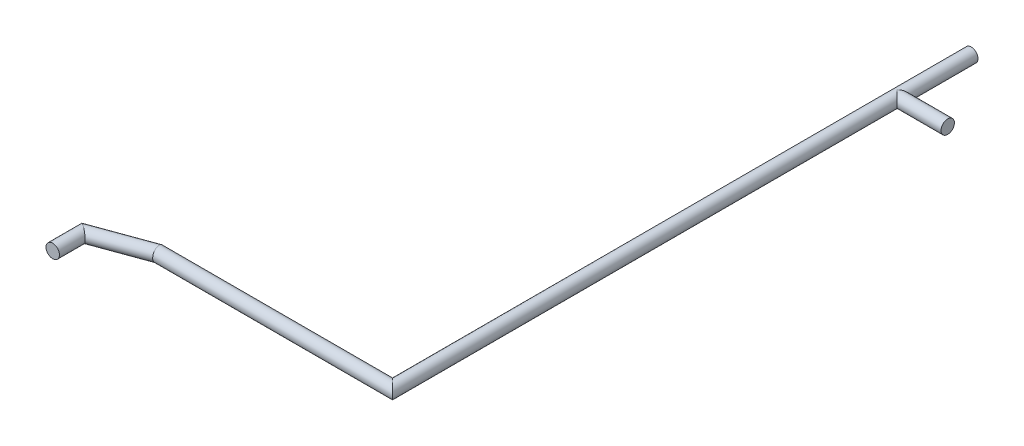
ISO-10303-21;
HEADER;
FILE_DESCRIPTION(('STEP AP214'),'2;1');
FILE_NAME('part.step','',(''),(''),'','','');
FILE_SCHEMA(('AUTOMOTIVE_DESIGN { 1 0 10303 214 1 1 1 1 }'));
ENDSEC;
DATA;
#1=APPLICATION_CONTEXT('core data for automotive mechanical design processes');
#2=APPLICATION_PROTOCOL_DEFINITION('international standard','automotive_design',2000,#1);
#3=PRODUCT_CONTEXT('',#1,'mechanical');
#4=PRODUCT('Part','Part','',(#3));
#5=PRODUCT_RELATED_PRODUCT_CATEGORY('part','',(#4));
#6=PRODUCT_DEFINITION_FORMATION('','',#4);
#7=PRODUCT_DEFINITION_CONTEXT('part definition',#1,'design');
#8=PRODUCT_DEFINITION('design','',#6,#7);
#9=PRODUCT_DEFINITION_SHAPE('','',#8);
#10=(LENGTH_UNIT() NAMED_UNIT(*) SI_UNIT(.MILLI.,.METRE.));
#11=(NAMED_UNIT(*) PLANE_ANGLE_UNIT() SI_UNIT($,.RADIAN.));
#12=(NAMED_UNIT(*) SI_UNIT($,.STERADIAN.) SOLID_ANGLE_UNIT());
#13=UNCERTAINTY_MEASURE_WITH_UNIT(LENGTH_MEASURE(1.E-05),#10,'distance_accuracy_value','');
#14=(GEOMETRIC_REPRESENTATION_CONTEXT(3) GLOBAL_UNCERTAINTY_ASSIGNED_CONTEXT((#13)) GLOBAL_UNIT_ASSIGNED_CONTEXT((#10,
#11,#12)) REPRESENTATION_CONTEXT('',''));
#15=CARTESIAN_POINT('',(0.,0.,0.));
#16=DIRECTION('',(0.,0.,1.));
#17=DIRECTION('',(1.,0.,0.));
#18=AXIS2_PLACEMENT_3D('',#15,#16,#17);
#19=CARTESIAN_POINT('',(-1.6,0.,23.6));
#20=DIRECTION('',(-1.,0.,0.));
#21=DIRECTION('',(0.,0.,-1.));
#22=AXIS2_PLACEMENT_3D('',#19,#20,#21);
#23=CYLINDRICAL_SURFACE('',#22,0.1);
#24=CARTESIAN_POINT('',(-3.38236730192558,0.,23.6));
#25=DIRECTION('',(0.984807753006185,0.,-0.17364817770109));
#26=DIRECTION('',(-0.17364817770109,0.,-0.984807753006185));
#27=AXIS2_PLACEMENT_3D('',#24,#25,#26);
#28=ELLIPSE('',#27,0.101542661189196,0.1);
#29=CARTESIAN_POINT('',(-3.38236730192558,-0.099999999999372,23.6));
#30=VERTEX_POINT('',#29);
#31=CARTESIAN_POINT('',(-3.38236730192653,0.1,23.5999999999946));
#32=VERTEX_POINT('',#31);
#33=EDGE_CURVE('E25',#30,#32,#28,.T.);
#34=ORIENTED_EDGE('',*,*,#33,.T.);
#35=CARTESIAN_POINT('',(-3.38236730192558,0.,23.6));
#36=DIRECTION('',(0.984807753006185,0.,-0.17364817770109));
#37=DIRECTION('',(-0.17364817770109,0.,-0.984807753006185));
#38=AXIS2_PLACEMENT_3D('',#35,#36,#37);
#39=ELLIPSE('',#38,0.101542661189196,0.1);
#40=EDGE_CURVE('E10',#32,#30,#39,.T.);
#41=ORIENTED_EDGE('',*,*,#40,.T.);
#42=EDGE_LOOP('',(#34,#41));
#43=FACE_BOUND('',#42,.T.);
#44=CARTESIAN_POINT('',(0.100000000000003,0.,23.6));
#45=DIRECTION('',(-0.707106781186547,0.,0.707106781186548));
#46=DIRECTION('',(-0.707106781186548,0.,-0.707106781186547));
#47=AXIS2_PLACEMENT_3D('',#44,#45,#46);
#48=ELLIPSE('',#47,0.14142135623731,0.1);
#49=CARTESIAN_POINT('',(0.100000000000003,-0.100000000001902,23.6));
#50=VERTEX_POINT('',#49);
#51=CARTESIAN_POINT('',(0.100000000000001,0.1,23.6));
#52=VERTEX_POINT('',#51);
#53=EDGE_CURVE('E19',#50,#52,#48,.T.);
#54=ORIENTED_EDGE('',*,*,#53,.T.);
#55=CARTESIAN_POINT('',(0.100000000000003,0.,23.6));
#56=DIRECTION('',(-0.707106781186547,0.,0.707106781186548));
#57=DIRECTION('',(-0.707106781186548,0.,-0.707106781186547));
#58=AXIS2_PLACEMENT_3D('',#55,#56,#57);
#59=ELLIPSE('',#58,0.14142135623731,0.1);
#60=EDGE_CURVE('E61',#52,#50,#59,.T.);
#61=ORIENTED_EDGE('',*,*,#60,.T.);
#62=EDGE_LOOP('',(#54,#61));
#63=FACE_BOUND('',#62,.T.);
#64=ADVANCED_FACE('F15',(#43,#63),#23,.T.);
#65=CARTESIAN_POINT('',(-3.81579798567656,0.,23.7577558674773));
#66=DIRECTION('',(-0.939692620795807,0.,0.342020143298474));
#67=DIRECTION('',(-0.342020143298474,0.,-0.939692620795807));
#68=AXIS2_PLACEMENT_3D('',#65,#66,#67);
#69=CYLINDRICAL_SURFACE('',#68,0.100000000000446);
#70=CARTESIAN_POINT('',(-4.20000000000226,0.,23.8975939646245));
#71=DIRECTION('',(0.573576436378722,0.,-0.819152044269613));
#72=DIRECTION('',(-0.819152044269613,0.,-0.573576436378723));
#73=AXIS2_PLACEMENT_3D('',#70,#71,#72);
#74=ELLIPSE('',#73,0.122077458876276,0.100000000000446);
#75=CARTESIAN_POINT('',(-4.20000000000226,-0.10000000000371,23.8975939646245));
#76=VERTEX_POINT('',#75);
#77=CARTESIAN_POINT('',(-4.20000000000113,0.100000000000446,23.8975939646252));
#78=VERTEX_POINT('',#77);
#79=EDGE_CURVE('E83',#76,#78,#74,.T.);
#80=ORIENTED_EDGE('',*,*,#79,.T.);
#81=CARTESIAN_POINT('',(-4.20000000000226,0.,23.8975939646245));
#82=DIRECTION('',(0.573576436378722,0.,-0.819152044269613));
#83=DIRECTION('',(-0.819152044269613,0.,-0.573576436378723));
#84=AXIS2_PLACEMENT_3D('',#81,#82,#83);
#85=ELLIPSE('',#84,0.122077458876276,0.100000000000446);
#86=EDGE_CURVE('E73',#78,#76,#85,.T.);
#87=ORIENTED_EDGE('',*,*,#86,.T.);
#88=EDGE_LOOP('',(#80,#87));
#89=FACE_BOUND('',#88,.T.);
#90=ORIENTED_EDGE('',*,*,#33,.F.);
#91=ORIENTED_EDGE('',*,*,#40,.F.);
#92=EDGE_LOOP('',(#90,#91));
#93=FACE_BOUND('',#92,.T.);
#94=ADVANCED_FACE('F108',(#89,#93),#69,.T.);
#95=CARTESIAN_POINT('',(-4.2,0.,24.35));
#96=DIRECTION('',(0.,0.,1.));
#97=DIRECTION('',(1.,0.,0.));
#98=AXIS2_PLACEMENT_3D('',#95,#96,#97);
#99=PLANE('',#98);
#100=CARTESIAN_POINT('',(-4.2,0.,24.35));
#101=DIRECTION('',(0.,0.,1.));
#102=DIRECTION('',(1.,0.,0.));
#103=AXIS2_PLACEMENT_3D('',#100,#101,#102);
#104=CIRCLE('',#103,0.1);
#105=CARTESIAN_POINT('',(-4.1,0.,24.35));
#106=VERTEX_POINT('',#105);
#107=EDGE_CURVE('E78',#106,#106,#104,.T.);
#108=ORIENTED_EDGE('',*,*,#107,.T.);
#109=EDGE_LOOP('',(#108));
#110=FACE_BOUND('',#109,.T.);
#111=ADVANCED_FACE('F79',(#110),#99,.T.);
#112=CARTESIAN_POINT('',(-4.2,0.,24.0887866054));
#113=DIRECTION('',(0.,0.,-1.));
#114=DIRECTION('',(1.,0.,0.));
#115=AXIS2_PLACEMENT_3D('',#112,#113,#114);
#116=CYLINDRICAL_SURFACE('',#115,0.1);
#117=ORIENTED_EDGE('',*,*,#107,.F.);
#118=EDGE_LOOP('',(#117));
#119=FACE_BOUND('',#118,.T.);
#120=ORIENTED_EDGE('',*,*,#79,.F.);
#121=ORIENTED_EDGE('',*,*,#86,.F.);
#122=EDGE_LOOP('',(#120,#121));
#123=FACE_BOUND('',#122,.T.);
#124=ADVANCED_FACE('F104',(#119,#123),#116,.T.);
#125=CARTESIAN_POINT('',(0.1,0.,15.));
#126=DIRECTION('',(0.,0.,-1.));
#127=DIRECTION('',(-1.,0.,0.));
#128=AXIS2_PLACEMENT_3D('',#125,#126,#127);
#129=PLANE('',#128);
#130=CARTESIAN_POINT('',(0.1,0.,15.));
#131=DIRECTION('',(0.,0.,-1.));
#132=DIRECTION('',(1.,0.,0.));
#133=AXIS2_PLACEMENT_3D('',#130,#131,#132);
#134=CIRCLE('',#133,0.1);
#135=CARTESIAN_POINT('',(0.2,0.,15.));
#136=VERTEX_POINT('',#135);
#137=EDGE_CURVE('E67',#136,#136,#134,.T.);
#138=ORIENTED_EDGE('',*,*,#137,.T.);
#139=EDGE_LOOP('',(#138));
#140=FACE_BOUND('',#139,.T.);
#141=ADVANCED_FACE('F96',(#140),#129,.T.);
#142=CARTESIAN_POINT('',(0.1,0.,19.35));
#143=DIRECTION('',(0.,0.,-1.));
#144=DIRECTION('',(1.,0.,0.));
#145=AXIS2_PLACEMENT_3D('',#142,#143,#144);
#146=CYLINDRICAL_SURFACE('',#145,0.1);
#147=ORIENTED_EDGE('',*,*,#137,.F.);
#148=EDGE_LOOP('',(#147));
#149=FACE_BOUND('',#148,.T.);
#150=ORIENTED_EDGE('',*,*,#53,.F.);
#151=ORIENTED_EDGE('',*,*,#60,.F.);
#152=EDGE_LOOP('',(#150,#151));
#153=FACE_BOUND('',#152,.T.);
#154=CARTESIAN_POINT('',(0.1,0.,16.1));
#155=DIRECTION('',(-0.707106781186553,0.,0.707106781186543));
#156=DIRECTION('',(-0.707106781186543,0.,-0.707106781186553));
#157=AXIS2_PLACEMENT_3D('',#154,#155,#156);
#158=ELLIPSE('',#157,0.141421356237308,0.1);
#159=CARTESIAN_POINT('',(0.1,-0.1,16.1));
#160=VERTEX_POINT('',#159);
#161=CARTESIAN_POINT('',(0.1,0.1,16.1));
#162=VERTEX_POINT('',#161);
#163=EDGE_CURVE('E53',#160,#162,#158,.T.);
#164=ORIENTED_EDGE('',*,*,#163,.T.);
#165=CARTESIAN_POINT('',(0.1,0.,16.1));
#166=DIRECTION('',(-0.707106781186553,0.,-0.707106781186543));
#167=DIRECTION('',(0.707106781186543,0.,-0.707106781186553));
#168=AXIS2_PLACEMENT_3D('',#165,#166,#167);
#169=ELLIPSE('',#168,0.141421356237308,0.1);
#170=EDGE_CURVE('E88',#162,#160,#169,.T.);
#171=ORIENTED_EDGE('',*,*,#170,.T.);
#172=EDGE_LOOP('',(#164,#171));
#173=FACE_BOUND('',#172,.T.);
#174=ADVANCED_FACE('F93',(#149,#153,#173),#146,.T.);
#175=CARTESIAN_POINT('',(0.85,0.,16.1));
#176=DIRECTION('',(1.,0.,0.));
#177=DIRECTION('',(0.,0.,-1.));
#178=AXIS2_PLACEMENT_3D('',#175,#176,#177);
#179=PLANE('',#178);
#180=CARTESIAN_POINT('',(0.85,0.,16.1));
#181=DIRECTION('',(1.,0.,0.));
#182=DIRECTION('',(0.,0.,-1.));
#183=AXIS2_PLACEMENT_3D('',#180,#181,#182);
#184=CIRCLE('',#183,0.1);
#185=CARTESIAN_POINT('',(0.85,0.,16.));
#186=VERTEX_POINT('',#185);
#187=EDGE_CURVE('E43',#186,#186,#184,.T.);
#188=ORIENTED_EDGE('',*,*,#187,.T.);
#189=EDGE_LOOP('',(#188));
#190=FACE_BOUND('',#189,.T.);
#191=ADVANCED_FACE('F95',(#190),#179,.T.);
#192=CARTESIAN_POINT('',(0.475,0.,16.1));
#193=DIRECTION('',(-1.,0.,0.));
#194=DIRECTION('',(0.,0.,-1.));
#195=AXIS2_PLACEMENT_3D('',#192,#193,#194);
#196=CYLINDRICAL_SURFACE('',#195,0.1);
#197=ORIENTED_EDGE('',*,*,#187,.F.);
#198=EDGE_LOOP('',(#197));
#199=FACE_BOUND('',#198,.T.);
#200=ORIENTED_EDGE('',*,*,#170,.F.);
#201=ORIENTED_EDGE('',*,*,#163,.F.);
#202=EDGE_LOOP('',(#200,#201));
#203=FACE_BOUND('',#202,.T.);
#204=ADVANCED_FACE('F17',(#199,#203),#196,.T.);
#205=CLOSED_SHELL('',(#64,#94,#111,#124,#141,#174,#191,#204));
#206=MANIFOLD_SOLID_BREP('B1',#205);
#207=ADVANCED_BREP_SHAPE_REPRESENTATION('',(#18,#206),#14);
#208=SHAPE_DEFINITION_REPRESENTATION(#9,#207);
ENDSEC;
END-ISO-10303-21;
